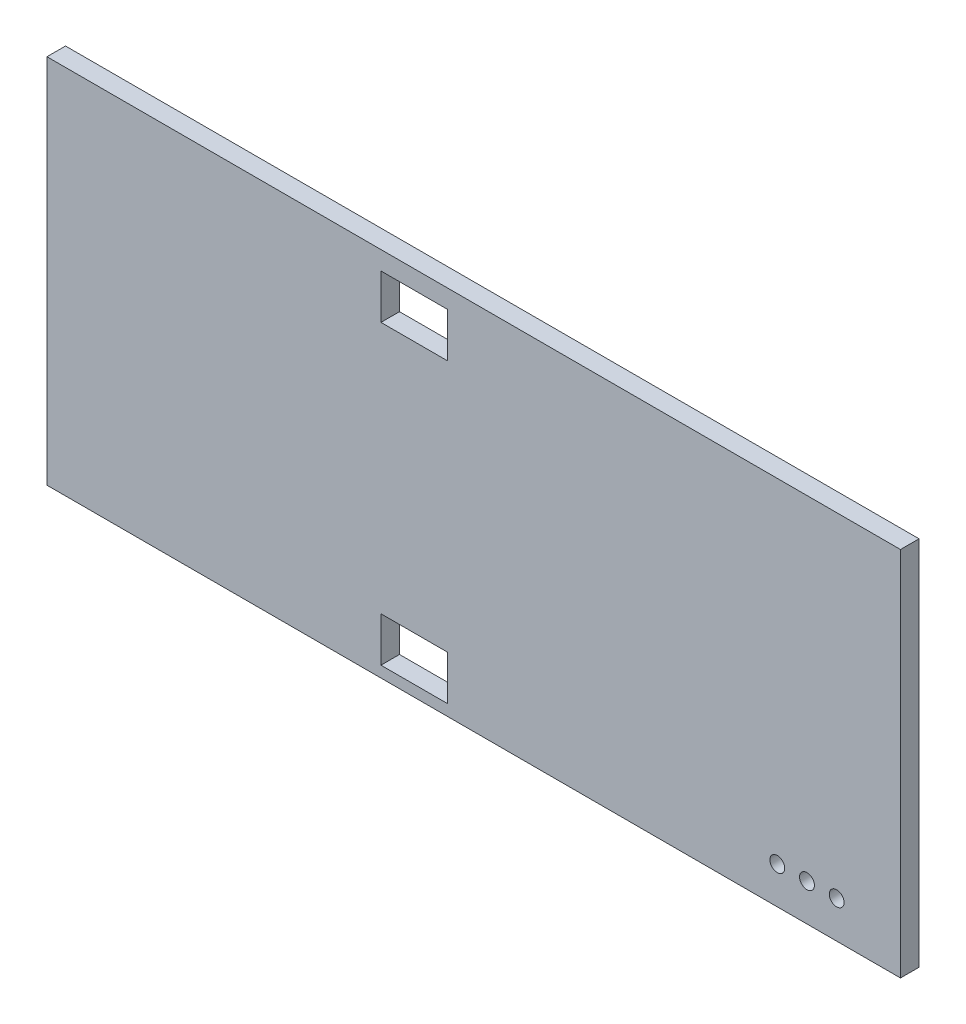
ISO-10303-21;
HEADER;
FILE_DESCRIPTION(('STEP AP214'),'2;1');
FILE_NAME('part.step','',(''),(''),'','','');
FILE_SCHEMA(('AUTOMOTIVE_DESIGN { 1 0 10303 214 1 1 1 1 }'));
ENDSEC;
DATA;
#1=APPLICATION_CONTEXT('core data for automotive mechanical design processes');
#2=APPLICATION_PROTOCOL_DEFINITION('international standard','automotive_design',2000,#1);
#3=PRODUCT_CONTEXT('',#1,'mechanical');
#4=PRODUCT('Part','Part','',(#3));
#5=PRODUCT_RELATED_PRODUCT_CATEGORY('part','',(#4));
#6=PRODUCT_DEFINITION_FORMATION('','',#4);
#7=PRODUCT_DEFINITION_CONTEXT('part definition',#1,'design');
#8=PRODUCT_DEFINITION('design','',#6,#7);
#9=PRODUCT_DEFINITION_SHAPE('','',#8);
#10=(LENGTH_UNIT() NAMED_UNIT(*) SI_UNIT(.MILLI.,.METRE.));
#11=(NAMED_UNIT(*) PLANE_ANGLE_UNIT() SI_UNIT($,.RADIAN.));
#12=(NAMED_UNIT(*) SI_UNIT($,.STERADIAN.) SOLID_ANGLE_UNIT());
#13=UNCERTAINTY_MEASURE_WITH_UNIT(LENGTH_MEASURE(1.E-05),#10,'distance_accuracy_value','');
#14=(GEOMETRIC_REPRESENTATION_CONTEXT(3) GLOBAL_UNCERTAINTY_ASSIGNED_CONTEXT((#13)) GLOBAL_UNIT_ASSIGNED_CONTEXT((#10,
#11,#12)) REPRESENTATION_CONTEXT('',''));
#15=CARTESIAN_POINT('',(0.,0.,0.));
#16=DIRECTION('',(0.,0.,1.));
#17=DIRECTION('',(1.,0.,0.));
#18=AXIS2_PLACEMENT_3D('',#15,#16,#17);
#19=CARTESIAN_POINT('',(0.,0.,6.35));
#20=DIRECTION('',(-1.,0.,0.));
#21=DIRECTION('',(0.,0.,1.));
#22=AXIS2_PLACEMENT_3D('',#19,#20,#21);
#23=PLANE('',#22);
#24=DIRECTION('',(0.,1.,0.));
#25=VECTOR('',#24,1.);
#26=CARTESIAN_POINT('',(0.,0.,0.));
#27=LINE('',#26,#25);
#28=CARTESIAN_POINT('',(0.,0.,0.));
#29=VERTEX_POINT('',#28);
#30=CARTESIAN_POINT('',(0.,127.,0.));
#31=VERTEX_POINT('',#30);
#32=EDGE_CURVE('E216',#29,#31,#27,.T.);
#33=ORIENTED_EDGE('',*,*,#32,.F.);
#34=DIRECTION('',(0.,0.,-1.));
#35=VECTOR('',#34,1.);
#36=CARTESIAN_POINT('',(0.,0.,6.35));
#37=LINE('',#36,#35);
#38=CARTESIAN_POINT('',(0.,0.,6.35));
#39=VERTEX_POINT('',#38);
#40=EDGE_CURVE('E11',#39,#29,#37,.T.);
#41=ORIENTED_EDGE('',*,*,#40,.F.);
#42=DIRECTION('',(0.,1.,0.));
#43=VECTOR('',#42,1.);
#44=CARTESIAN_POINT('',(0.,0.,6.35));
#45=LINE('',#44,#43);
#46=CARTESIAN_POINT('',(0.,127.,6.35));
#47=VERTEX_POINT('',#46);
#48=EDGE_CURVE('E226',#39,#47,#45,.T.);
#49=ORIENTED_EDGE('',*,*,#48,.T.);
#50=DIRECTION('',(0.,0.,-1.));
#51=VECTOR('',#50,1.);
#52=CARTESIAN_POINT('',(0.,127.,6.35));
#53=LINE('',#52,#51);
#54=EDGE_CURVE('E42',#47,#31,#53,.T.);
#55=ORIENTED_EDGE('',*,*,#54,.T.);
#56=EDGE_LOOP('',(#33,#41,#49,#55));
#57=FACE_BOUND('',#56,.T.);
#58=ADVANCED_FACE('F39',(#57),#23,.T.);
#59=CARTESIAN_POINT('',(0.,0.,6.35));
#60=DIRECTION('',(0.,1.,0.));
#61=DIRECTION('',(0.,0.,1.));
#62=AXIS2_PLACEMENT_3D('',#59,#60,#61);
#63=PLANE('',#62);
#64=DIRECTION('',(1.,0.,0.));
#65=VECTOR('',#64,1.);
#66=CARTESIAN_POINT('',(0.,0.,0.));
#67=LINE('',#66,#65);
#68=CARTESIAN_POINT('',(292.1,0.,0.));
#69=VERTEX_POINT('',#68);
#70=EDGE_CURVE('E231',#29,#69,#67,.T.);
#71=ORIENTED_EDGE('',*,*,#70,.T.);
#72=DIRECTION('',(0.,0.,-1.));
#73=VECTOR('',#72,1.);
#74=CARTESIAN_POINT('',(292.1,0.,6.35));
#75=LINE('',#74,#73);
#76=CARTESIAN_POINT('',(292.1,0.,6.35));
#77=VERTEX_POINT('',#76);
#78=EDGE_CURVE('E48',#77,#69,#75,.T.);
#79=ORIENTED_EDGE('',*,*,#78,.F.);
#80=DIRECTION('',(1.,0.,0.));
#81=VECTOR('',#80,1.);
#82=CARTESIAN_POINT('',(0.,0.,6.35));
#83=LINE('',#82,#81);
#84=EDGE_CURVE('E238',#39,#77,#83,.T.);
#85=ORIENTED_EDGE('',*,*,#84,.F.);
#86=ORIENTED_EDGE('',*,*,#40,.T.);
#87=EDGE_LOOP('',(#71,#79,#85,#86));
#88=FACE_BOUND('',#87,.T.);
#89=ADVANCED_FACE('F272',(#88),#63,.F.);
#90=CARTESIAN_POINT('',(292.1,0.,6.35));
#91=DIRECTION('',(-1.,0.,0.));
#92=DIRECTION('',(0.,0.,1.));
#93=AXIS2_PLACEMENT_3D('',#90,#91,#92);
#94=PLANE('',#93);
#95=DIRECTION('',(0.,1.,0.));
#96=VECTOR('',#95,1.);
#97=CARTESIAN_POINT('',(292.1,0.,0.));
#98=LINE('',#97,#96);
#99=CARTESIAN_POINT('',(292.1,127.,0.));
#100=VERTEX_POINT('',#99);
#101=EDGE_CURVE('E248',#69,#100,#98,.T.);
#102=ORIENTED_EDGE('',*,*,#101,.T.);
#103=DIRECTION('',(0.,0.,-1.));
#104=VECTOR('',#103,1.);
#105=CARTESIAN_POINT('',(292.1,127.,6.35));
#106=LINE('',#105,#104);
#107=CARTESIAN_POINT('',(292.1,127.,6.35));
#108=VERTEX_POINT('',#107);
#109=EDGE_CURVE('E256',#108,#100,#106,.T.);
#110=ORIENTED_EDGE('',*,*,#109,.F.);
#111=DIRECTION('',(0.,1.,0.));
#112=VECTOR('',#111,1.);
#113=CARTESIAN_POINT('',(292.1,0.,6.35));
#114=LINE('',#113,#112);
#115=EDGE_CURVE('E235',#77,#108,#114,.T.);
#116=ORIENTED_EDGE('',*,*,#115,.F.);
#117=ORIENTED_EDGE('',*,*,#78,.T.);
#118=EDGE_LOOP('',(#102,#110,#116,#117));
#119=FACE_BOUND('',#118,.T.);
#120=ADVANCED_FACE('F276',(#119),#94,.F.);
#121=CARTESIAN_POINT('',(0.,127.,6.35));
#122=DIRECTION('',(0.,1.,0.));
#123=DIRECTION('',(0.,0.,1.));
#124=AXIS2_PLACEMENT_3D('',#121,#122,#123);
#125=PLANE('',#124);
#126=DIRECTION('',(1.,0.,0.));
#127=VECTOR('',#126,1.);
#128=CARTESIAN_POINT('',(0.,127.,0.));
#129=LINE('',#128,#127);
#130=EDGE_CURVE('E244',#31,#100,#129,.T.);
#131=ORIENTED_EDGE('',*,*,#130,.F.);
#132=ORIENTED_EDGE('',*,*,#54,.F.);
#133=DIRECTION('',(1.,0.,0.));
#134=VECTOR('',#133,1.);
#135=CARTESIAN_POINT('',(0.,127.,6.35));
#136=LINE('',#135,#134);
#137=EDGE_CURVE('E230',#47,#108,#136,.T.);
#138=ORIENTED_EDGE('',*,*,#137,.T.);
#139=ORIENTED_EDGE('',*,*,#109,.T.);
#140=EDGE_LOOP('',(#131,#132,#138,#139));
#141=FACE_BOUND('',#140,.T.);
#142=ADVANCED_FACE('F266',(#141),#125,.T.);
#143=CARTESIAN_POINT('',(0.,0.,6.35));
#144=DIRECTION('',(0.,0.,-1.));
#145=DIRECTION('',(-1.,0.,0.));
#146=AXIS2_PLACEMENT_3D('',#143,#144,#145);
#147=PLANE('',#146);
#148=CARTESIAN_POINT('',(249.940607709812,12.7,6.35));
#149=DIRECTION('',(0.,0.,1.));
#150=DIRECTION('',(1.,0.,0.));
#151=AXIS2_PLACEMENT_3D('',#148,#149,#150);
#152=CIRCLE('',#151,2.54000000000001);
#153=CARTESIAN_POINT('',(252.480607709812,12.7,6.35));
#154=VERTEX_POINT('',#153);
#155=EDGE_CURVE('E428',#154,#154,#152,.T.);
#156=ORIENTED_EDGE('',*,*,#155,.F.);
#157=EDGE_LOOP('',(#156));
#158=FACE_BOUND('',#157,.T.);
#159=CARTESIAN_POINT('',(260.100607709812,12.7,6.35));
#160=DIRECTION('',(0.,0.,1.));
#161=DIRECTION('',(1.,0.,0.));
#162=AXIS2_PLACEMENT_3D('',#159,#160,#161);
#163=CIRCLE('',#162,2.54000000000001);
#164=CARTESIAN_POINT('',(262.640607709812,12.7,6.35));
#165=VERTEX_POINT('',#164);
#166=EDGE_CURVE('E436',#165,#165,#163,.T.);
#167=ORIENTED_EDGE('',*,*,#166,.F.);
#168=EDGE_LOOP('',(#167));
#169=FACE_BOUND('',#168,.T.);
#170=CARTESIAN_POINT('',(270.260607709812,12.7,6.35));
#171=DIRECTION('',(0.,0.,1.));
#172=DIRECTION('',(1.,0.,0.));
#173=AXIS2_PLACEMENT_3D('',#170,#171,#172);
#174=CIRCLE('',#173,2.54000000000001);
#175=CARTESIAN_POINT('',(272.800607709812,12.7,6.35));
#176=VERTEX_POINT('',#175);
#177=EDGE_CURVE('E157',#176,#176,#174,.T.);
#178=ORIENTED_EDGE('',*,*,#177,.F.);
#179=EDGE_LOOP('',(#178));
#180=FACE_BOUND('',#179,.T.);
#181=DIRECTION('',(1.,0.,0.));
#182=VECTOR('',#181,1.);
#183=CARTESIAN_POINT('',(114.3,105.41,6.35));
#184=LINE('',#183,#182);
#185=CARTESIAN_POINT('',(114.3,105.41,6.35));
#186=VERTEX_POINT('',#185);
#187=CARTESIAN_POINT('',(137.16,105.41,6.35));
#188=VERTEX_POINT('',#187);
#189=EDGE_CURVE('E166',#186,#188,#184,.T.);
#190=ORIENTED_EDGE('',*,*,#189,.F.);
#191=DIRECTION('',(0.,-1.,0.));
#192=VECTOR('',#191,1.);
#193=CARTESIAN_POINT('',(114.3,120.65,6.35));
#194=LINE('',#193,#192);
#195=CARTESIAN_POINT('',(114.3,120.65,6.35));
#196=VERTEX_POINT('',#195);
#197=EDGE_CURVE('E56',#196,#186,#194,.T.);
#198=ORIENTED_EDGE('',*,*,#197,.F.);
#199=DIRECTION('',(-1.,0.,0.));
#200=VECTOR('',#199,1.);
#201=CARTESIAN_POINT('',(114.3,120.65,6.35));
#202=LINE('',#201,#200);
#203=CARTESIAN_POINT('',(137.16,120.65,6.35));
#204=VERTEX_POINT('',#203);
#205=EDGE_CURVE('E150',#204,#196,#202,.T.);
#206=ORIENTED_EDGE('',*,*,#205,.F.);
#207=DIRECTION('',(0.,1.,0.));
#208=VECTOR('',#207,1.);
#209=CARTESIAN_POINT('',(137.16,120.65,6.35));
#210=LINE('',#209,#208);
#211=EDGE_CURVE('E154',#188,#204,#210,.T.);
#212=ORIENTED_EDGE('',*,*,#211,.F.);
#213=EDGE_LOOP('',(#190,#198,#206,#212));
#214=FACE_BOUND('',#213,.T.);
#215=DIRECTION('',(1.,0.,0.));
#216=VECTOR('',#215,1.);
#217=CARTESIAN_POINT('',(114.3,3.81,6.35));
#218=LINE('',#217,#216);
#219=CARTESIAN_POINT('',(114.3,3.81,6.35));
#220=VERTEX_POINT('',#219);
#221=CARTESIAN_POINT('',(137.16,3.81,6.35));
#222=VERTEX_POINT('',#221);
#223=EDGE_CURVE('E202',#220,#222,#218,.T.);
#224=ORIENTED_EDGE('',*,*,#223,.F.);
#225=DIRECTION('',(0.,-1.,0.));
#226=VECTOR('',#225,1.);
#227=CARTESIAN_POINT('',(114.3,19.05,6.35));
#228=LINE('',#227,#226);
#229=CARTESIAN_POINT('',(114.3,19.05,6.35));
#230=VERTEX_POINT('',#229);
#231=EDGE_CURVE('E176',#230,#220,#228,.T.);
#232=ORIENTED_EDGE('',*,*,#231,.F.);
#233=DIRECTION('',(-1.,0.,0.));
#234=VECTOR('',#233,1.);
#235=CARTESIAN_POINT('',(114.3,19.05,6.35));
#236=LINE('',#235,#234);
#237=CARTESIAN_POINT('',(137.16,19.05,6.35));
#238=VERTEX_POINT('',#237);
#239=EDGE_CURVE('E187',#238,#230,#236,.T.);
#240=ORIENTED_EDGE('',*,*,#239,.F.);
#241=DIRECTION('',(0.,1.,0.));
#242=VECTOR('',#241,1.);
#243=CARTESIAN_POINT('',(137.16,19.05,6.35));
#244=LINE('',#243,#242);
#245=EDGE_CURVE('E206',#222,#238,#244,.T.);
#246=ORIENTED_EDGE('',*,*,#245,.F.);
#247=EDGE_LOOP('',(#224,#232,#240,#246));
#248=FACE_BOUND('',#247,.T.);
#249=ORIENTED_EDGE('',*,*,#48,.F.);
#250=ORIENTED_EDGE('',*,*,#84,.T.);
#251=ORIENTED_EDGE('',*,*,#115,.T.);
#252=ORIENTED_EDGE('',*,*,#137,.F.);
#253=EDGE_LOOP('',(#249,#250,#251,#252));
#254=FACE_BOUND('',#253,.T.);
#255=ADVANCED_FACE('F278',(#158,#169,#180,#214,#248,#254),#147,.F.);
#256=CARTESIAN_POINT('',(0.,0.,0.));
#257=DIRECTION('',(0.,0.,-1.));
#258=DIRECTION('',(-1.,0.,0.));
#259=AXIS2_PLACEMENT_3D('',#256,#257,#258);
#260=PLANE('',#259);
#261=CARTESIAN_POINT('',(249.940607709812,12.7,0.));
#262=DIRECTION('',(0.,0.,1.));
#263=DIRECTION('',(1.,0.,0.));
#264=AXIS2_PLACEMENT_3D('',#261,#262,#263);
#265=CIRCLE('',#264,2.54000000000001);
#266=CARTESIAN_POINT('',(252.480607709812,12.7,0.));
#267=VERTEX_POINT('',#266);
#268=EDGE_CURVE('E167',#267,#267,#265,.T.);
#269=ORIENTED_EDGE('',*,*,#268,.T.);
#270=EDGE_LOOP('',(#269));
#271=FACE_BOUND('',#270,.T.);
#272=CARTESIAN_POINT('',(260.100607709812,12.7,0.));
#273=DIRECTION('',(0.,0.,1.));
#274=DIRECTION('',(1.,0.,0.));
#275=AXIS2_PLACEMENT_3D('',#272,#273,#274);
#276=CIRCLE('',#275,2.54000000000001);
#277=CARTESIAN_POINT('',(262.640607709812,12.7,0.));
#278=VERTEX_POINT('',#277);
#279=EDGE_CURVE('E430',#278,#278,#276,.T.);
#280=ORIENTED_EDGE('',*,*,#279,.T.);
#281=EDGE_LOOP('',(#280));
#282=FACE_BOUND('',#281,.T.);
#283=CARTESIAN_POINT('',(270.260607709812,12.7,0.));
#284=DIRECTION('',(0.,0.,1.));
#285=DIRECTION('',(1.,0.,0.));
#286=AXIS2_PLACEMENT_3D('',#283,#284,#285);
#287=CIRCLE('',#286,2.54000000000001);
#288=CARTESIAN_POINT('',(272.800607709812,12.7,0.));
#289=VERTEX_POINT('',#288);
#290=EDGE_CURVE('E441',#289,#289,#287,.T.);
#291=ORIENTED_EDGE('',*,*,#290,.T.);
#292=EDGE_LOOP('',(#291));
#293=FACE_BOUND('',#292,.T.);
#294=DIRECTION('',(0.,-1.,0.));
#295=VECTOR('',#294,1.);
#296=CARTESIAN_POINT('',(114.3,120.65,0.));
#297=LINE('',#296,#295);
#298=CARTESIAN_POINT('',(114.3,120.65,0.));
#299=VERTEX_POINT('',#298);
#300=CARTESIAN_POINT('',(114.3,105.41,0.));
#301=VERTEX_POINT('',#300);
#302=EDGE_CURVE('E131',#299,#301,#297,.T.);
#303=ORIENTED_EDGE('',*,*,#302,.T.);
#304=DIRECTION('',(1.,0.,0.));
#305=VECTOR('',#304,1.);
#306=CARTESIAN_POINT('',(114.3,105.41,0.));
#307=LINE('',#306,#305);
#308=CARTESIAN_POINT('',(137.16,105.41,0.));
#309=VERTEX_POINT('',#308);
#310=EDGE_CURVE('E141',#301,#309,#307,.T.);
#311=ORIENTED_EDGE('',*,*,#310,.T.);
#312=DIRECTION('',(0.,1.,0.));
#313=VECTOR('',#312,1.);
#314=CARTESIAN_POINT('',(137.16,120.65,0.));
#315=LINE('',#314,#313);
#316=CARTESIAN_POINT('',(137.16,120.65,0.));
#317=VERTEX_POINT('',#316);
#318=EDGE_CURVE('E64',#309,#317,#315,.T.);
#319=ORIENTED_EDGE('',*,*,#318,.T.);
#320=DIRECTION('',(-1.,0.,0.));
#321=VECTOR('',#320,1.);
#322=CARTESIAN_POINT('',(114.3,120.65,0.));
#323=LINE('',#322,#321);
#324=EDGE_CURVE('E138',#317,#299,#323,.T.);
#325=ORIENTED_EDGE('',*,*,#324,.T.);
#326=EDGE_LOOP('',(#303,#311,#319,#325));
#327=FACE_BOUND('',#326,.T.);
#328=DIRECTION('',(0.,-1.,0.));
#329=VECTOR('',#328,1.);
#330=CARTESIAN_POINT('',(114.3,19.05,0.));
#331=LINE('',#330,#329);
#332=CARTESIAN_POINT('',(114.3,19.05,0.));
#333=VERTEX_POINT('',#332);
#334=CARTESIAN_POINT('',(114.3,3.81,0.));
#335=VERTEX_POINT('',#334);
#336=EDGE_CURVE('E182',#333,#335,#331,.T.);
#337=ORIENTED_EDGE('',*,*,#336,.T.);
#338=DIRECTION('',(1.,0.,0.));
#339=VECTOR('',#338,1.);
#340=CARTESIAN_POINT('',(114.3,3.81,0.));
#341=LINE('',#340,#339);
#342=CARTESIAN_POINT('',(137.16,3.81,0.));
#343=VERTEX_POINT('',#342);
#344=EDGE_CURVE('E186',#335,#343,#341,.T.);
#345=ORIENTED_EDGE('',*,*,#344,.T.);
#346=DIRECTION('',(0.,1.,0.));
#347=VECTOR('',#346,1.);
#348=CARTESIAN_POINT('',(137.16,19.05,0.));
#349=LINE('',#348,#347);
#350=CARTESIAN_POINT('',(137.16,19.05,0.));
#351=VERTEX_POINT('',#350);
#352=EDGE_CURVE('E191',#343,#351,#349,.T.);
#353=ORIENTED_EDGE('',*,*,#352,.T.);
#354=DIRECTION('',(-1.,0.,0.));
#355=VECTOR('',#354,1.);
#356=CARTESIAN_POINT('',(114.3,19.05,0.));
#357=LINE('',#356,#355);
#358=EDGE_CURVE('E195',#351,#333,#357,.T.);
#359=ORIENTED_EDGE('',*,*,#358,.T.);
#360=EDGE_LOOP('',(#337,#345,#353,#359));
#361=FACE_BOUND('',#360,.T.);
#362=ORIENTED_EDGE('',*,*,#32,.T.);
#363=ORIENTED_EDGE('',*,*,#130,.T.);
#364=ORIENTED_EDGE('',*,*,#101,.F.);
#365=ORIENTED_EDGE('',*,*,#70,.F.);
#366=EDGE_LOOP('',(#362,#363,#364,#365));
#367=FACE_BOUND('',#366,.T.);
#368=ADVANCED_FACE('F146',(#271,#282,#293,#327,#361,#367),#260,.T.);
#369=CARTESIAN_POINT('',(114.3,19.05,0.));
#370=DIRECTION('',(-1.,0.,0.));
#371=DIRECTION('',(0.,0.,1.));
#372=AXIS2_PLACEMENT_3D('',#369,#370,#371);
#373=PLANE('',#372);
#374=ORIENTED_EDGE('',*,*,#231,.T.);
#375=DIRECTION('',(0.,0.,1.));
#376=VECTOR('',#375,1.);
#377=CARTESIAN_POINT('',(114.3,3.81,0.));
#378=LINE('',#377,#376);
#379=EDGE_CURVE('E199',#335,#220,#378,.T.);
#380=ORIENTED_EDGE('',*,*,#379,.F.);
#381=ORIENTED_EDGE('',*,*,#336,.F.);
#382=DIRECTION('',(0.,0.,1.));
#383=VECTOR('',#382,1.);
#384=CARTESIAN_POINT('',(114.3,19.05,0.));
#385=LINE('',#384,#383);
#386=EDGE_CURVE('E213',#333,#230,#385,.T.);
#387=ORIENTED_EDGE('',*,*,#386,.T.);
#388=EDGE_LOOP('',(#374,#380,#381,#387));
#389=FACE_BOUND('',#388,.T.);
#390=ADVANCED_FACE('F286',(#389),#373,.F.);
#391=CARTESIAN_POINT('',(114.3,19.05,0.));
#392=DIRECTION('',(0.,1.,0.));
#393=DIRECTION('',(0.,0.,1.));
#394=AXIS2_PLACEMENT_3D('',#391,#392,#393);
#395=PLANE('',#394);
#396=ORIENTED_EDGE('',*,*,#239,.T.);
#397=ORIENTED_EDGE('',*,*,#386,.F.);
#398=ORIENTED_EDGE('',*,*,#358,.F.);
#399=DIRECTION('',(0.,0.,1.));
#400=VECTOR('',#399,1.);
#401=CARTESIAN_POINT('',(137.16,19.05,0.));
#402=LINE('',#401,#400);
#403=EDGE_CURVE('E217',#351,#238,#402,.T.);
#404=ORIENTED_EDGE('',*,*,#403,.T.);
#405=EDGE_LOOP('',(#396,#397,#398,#404));
#406=FACE_BOUND('',#405,.T.);
#407=ADVANCED_FACE('F317',(#406),#395,.F.);
#408=CARTESIAN_POINT('',(137.16,19.05,0.));
#409=DIRECTION('',(1.,0.,0.));
#410=DIRECTION('',(0.,0.,-1.));
#411=AXIS2_PLACEMENT_3D('',#408,#409,#410);
#412=PLANE('',#411);
#413=ORIENTED_EDGE('',*,*,#245,.T.);
#414=ORIENTED_EDGE('',*,*,#403,.F.);
#415=ORIENTED_EDGE('',*,*,#352,.F.);
#416=DIRECTION('',(0.,0.,1.));
#417=VECTOR('',#416,1.);
#418=CARTESIAN_POINT('',(137.16,3.81,0.));
#419=LINE('',#418,#417);
#420=EDGE_CURVE('E220',#343,#222,#419,.T.);
#421=ORIENTED_EDGE('',*,*,#420,.T.);
#422=EDGE_LOOP('',(#413,#414,#415,#421));
#423=FACE_BOUND('',#422,.T.);
#424=ADVANCED_FACE('F327',(#423),#412,.F.);
#425=CARTESIAN_POINT('',(114.3,3.81,0.));
#426=DIRECTION('',(0.,-1.,0.));
#427=DIRECTION('',(0.,0.,-1.));
#428=AXIS2_PLACEMENT_3D('',#425,#426,#427);
#429=PLANE('',#428);
#430=ORIENTED_EDGE('',*,*,#223,.T.);
#431=ORIENTED_EDGE('',*,*,#420,.F.);
#432=ORIENTED_EDGE('',*,*,#344,.F.);
#433=ORIENTED_EDGE('',*,*,#379,.T.);
#434=EDGE_LOOP('',(#430,#431,#432,#433));
#435=FACE_BOUND('',#434,.T.);
#436=ADVANCED_FACE('F337',(#435),#429,.F.);
#437=CARTESIAN_POINT('',(114.3,120.65,0.));
#438=DIRECTION('',(-1.,0.,0.));
#439=DIRECTION('',(0.,0.,1.));
#440=AXIS2_PLACEMENT_3D('',#437,#438,#439);
#441=PLANE('',#440);
#442=ORIENTED_EDGE('',*,*,#197,.T.);
#443=DIRECTION('',(0.,0.,1.));
#444=VECTOR('',#443,1.);
#445=CARTESIAN_POINT('',(114.3,105.41,0.));
#446=LINE('',#445,#444);
#447=EDGE_CURVE('E127',#301,#186,#446,.T.);
#448=ORIENTED_EDGE('',*,*,#447,.F.);
#449=ORIENTED_EDGE('',*,*,#302,.F.);
#450=DIRECTION('',(0.,0.,1.));
#451=VECTOR('',#450,1.);
#452=CARTESIAN_POINT('',(114.3,120.65,0.));
#453=LINE('',#452,#451);
#454=EDGE_CURVE('E173',#299,#196,#453,.T.);
#455=ORIENTED_EDGE('',*,*,#454,.T.);
#456=EDGE_LOOP('',(#442,#448,#449,#455));
#457=FACE_BOUND('',#456,.T.);
#458=ADVANCED_FACE('F129',(#457),#441,.F.);
#459=CARTESIAN_POINT('',(114.3,120.65,0.));
#460=DIRECTION('',(0.,1.,0.));
#461=DIRECTION('',(0.,0.,1.));
#462=AXIS2_PLACEMENT_3D('',#459,#460,#461);
#463=PLANE('',#462);
#464=ORIENTED_EDGE('',*,*,#205,.T.);
#465=ORIENTED_EDGE('',*,*,#454,.F.);
#466=ORIENTED_EDGE('',*,*,#324,.F.);
#467=DIRECTION('',(0.,0.,1.));
#468=VECTOR('',#467,1.);
#469=CARTESIAN_POINT('',(137.16,120.65,0.));
#470=LINE('',#469,#468);
#471=EDGE_CURVE('E177',#317,#204,#470,.T.);
#472=ORIENTED_EDGE('',*,*,#471,.T.);
#473=EDGE_LOOP('',(#464,#465,#466,#472));
#474=FACE_BOUND('',#473,.T.);
#475=ADVANCED_FACE('F356',(#474),#463,.F.);
#476=CARTESIAN_POINT('',(137.16,120.65,0.));
#477=DIRECTION('',(1.,0.,0.));
#478=DIRECTION('',(0.,0.,-1.));
#479=AXIS2_PLACEMENT_3D('',#476,#477,#478);
#480=PLANE('',#479);
#481=ORIENTED_EDGE('',*,*,#211,.T.);
#482=ORIENTED_EDGE('',*,*,#471,.F.);
#483=ORIENTED_EDGE('',*,*,#318,.F.);
#484=DIRECTION('',(0.,0.,1.));
#485=VECTOR('',#484,1.);
#486=CARTESIAN_POINT('',(137.16,105.41,0.));
#487=LINE('',#486,#485);
#488=EDGE_CURVE('E137',#309,#188,#487,.T.);
#489=ORIENTED_EDGE('',*,*,#488,.T.);
#490=EDGE_LOOP('',(#481,#482,#483,#489));
#491=FACE_BOUND('',#490,.T.);
#492=ADVANCED_FACE('F365',(#491),#480,.F.);
#493=CARTESIAN_POINT('',(114.3,105.41,0.));
#494=DIRECTION('',(0.,-1.,0.));
#495=DIRECTION('',(0.,0.,-1.));
#496=AXIS2_PLACEMENT_3D('',#493,#494,#495);
#497=PLANE('',#496);
#498=ORIENTED_EDGE('',*,*,#189,.T.);
#499=ORIENTED_EDGE('',*,*,#488,.F.);
#500=ORIENTED_EDGE('',*,*,#310,.F.);
#501=ORIENTED_EDGE('',*,*,#447,.T.);
#502=EDGE_LOOP('',(#498,#499,#500,#501));
#503=FACE_BOUND('',#502,.T.);
#504=ADVANCED_FACE('F142',(#503),#497,.F.);
#505=CARTESIAN_POINT('',(270.260607709812,12.7,0.));
#506=DIRECTION('',(0.,0.,1.));
#507=DIRECTION('',(1.,0.,0.));
#508=AXIS2_PLACEMENT_3D('',#505,#506,#507);
#509=CYLINDRICAL_SURFACE('',#508,2.54000000000001);
#510=ORIENTED_EDGE('',*,*,#290,.F.);
#511=EDGE_LOOP('',(#510));
#512=FACE_BOUND('',#511,.T.);
#513=ORIENTED_EDGE('',*,*,#177,.T.);
#514=EDGE_LOOP('',(#513));
#515=FACE_BOUND('',#514,.T.);
#516=ADVANCED_FACE('F382',(#512,#515),#509,.F.);
#517=CARTESIAN_POINT('',(260.100607709812,12.7,0.));
#518=DIRECTION('',(0.,0.,1.));
#519=DIRECTION('',(1.,0.,0.));
#520=AXIS2_PLACEMENT_3D('',#517,#518,#519);
#521=CYLINDRICAL_SURFACE('',#520,2.54000000000001);
#522=ORIENTED_EDGE('',*,*,#279,.F.);
#523=EDGE_LOOP('',(#522));
#524=FACE_BOUND('',#523,.T.);
#525=ORIENTED_EDGE('',*,*,#166,.T.);
#526=EDGE_LOOP('',(#525));
#527=FACE_BOUND('',#526,.T.);
#528=ADVANCED_FACE('F400',(#524,#527),#521,.F.);
#529=CARTESIAN_POINT('',(249.940607709812,12.7,0.));
#530=DIRECTION('',(0.,0.,1.));
#531=DIRECTION('',(1.,0.,0.));
#532=AXIS2_PLACEMENT_3D('',#529,#530,#531);
#533=CYLINDRICAL_SURFACE('',#532,2.54000000000001);
#534=ORIENTED_EDGE('',*,*,#268,.F.);
#535=EDGE_LOOP('',(#534));
#536=FACE_BOUND('',#535,.T.);
#537=ORIENTED_EDGE('',*,*,#155,.T.);
#538=EDGE_LOOP('',(#537));
#539=FACE_BOUND('',#538,.T.);
#540=ADVANCED_FACE('F410',(#536,#539),#533,.F.);
#541=CLOSED_SHELL('',(#58,#89,#120,#142,#255,#368,#390,#407,#424,#436,#458,#475,#492,#504,#516,
#528,#540));
#542=MANIFOLD_SOLID_BREP('B2',#541);
#543=ADVANCED_BREP_SHAPE_REPRESENTATION('',(#18,#542),#14);
#544=SHAPE_DEFINITION_REPRESENTATION(#9,#543);
ENDSEC;
END-ISO-10303-21;
